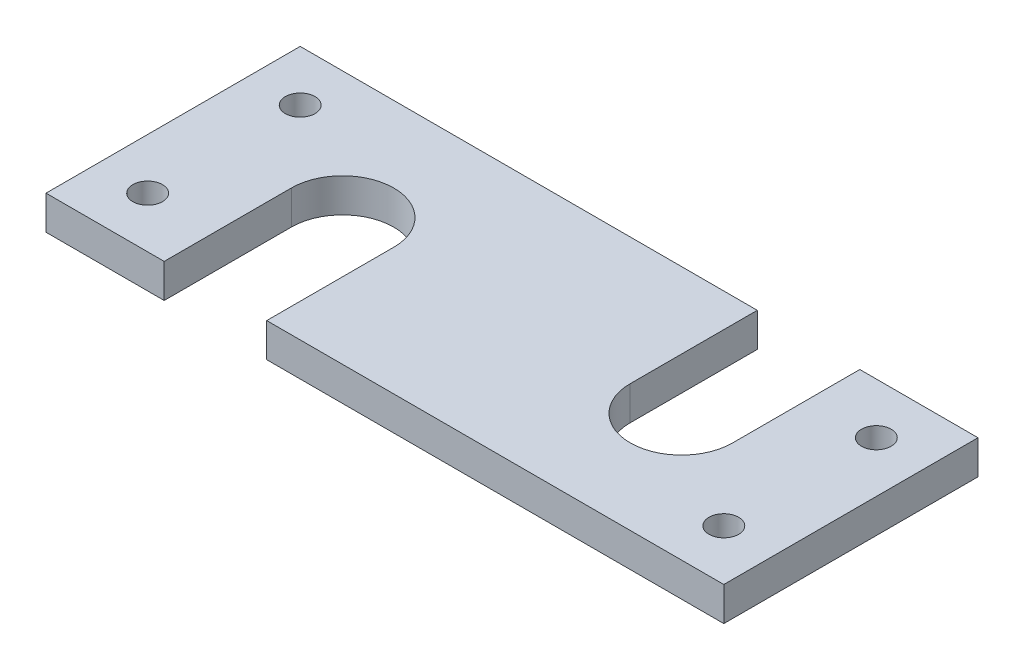
ISO-10303-21;
HEADER;
FILE_DESCRIPTION(('STEP AP214'),'2;1');
FILE_NAME('part.step','',(''),(''),'','','');
FILE_SCHEMA(('AUTOMOTIVE_DESIGN { 1 0 10303 214 1 1 1 1 }'));
ENDSEC;
DATA;
#1=APPLICATION_CONTEXT('core data for automotive mechanical design processes');
#2=APPLICATION_PROTOCOL_DEFINITION('international standard','automotive_design',2000,#1);
#3=PRODUCT_CONTEXT('',#1,'mechanical');
#4=PRODUCT('Part','Part','',(#3));
#5=PRODUCT_RELATED_PRODUCT_CATEGORY('part','',(#4));
#6=PRODUCT_DEFINITION_FORMATION('','',#4);
#7=PRODUCT_DEFINITION_CONTEXT('part definition',#1,'design');
#8=PRODUCT_DEFINITION('design','',#6,#7);
#9=PRODUCT_DEFINITION_SHAPE('','',#8);
#10=(LENGTH_UNIT() NAMED_UNIT(*) SI_UNIT(.MILLI.,.METRE.));
#11=(NAMED_UNIT(*) PLANE_ANGLE_UNIT() SI_UNIT($,.RADIAN.));
#12=(NAMED_UNIT(*) SI_UNIT($,.STERADIAN.) SOLID_ANGLE_UNIT());
#13=UNCERTAINTY_MEASURE_WITH_UNIT(LENGTH_MEASURE(1.E-05),#10,'distance_accuracy_value','');
#14=(GEOMETRIC_REPRESENTATION_CONTEXT(3) GLOBAL_UNCERTAINTY_ASSIGNED_CONTEXT((#13)) GLOBAL_UNIT_ASSIGNED_CONTEXT((#10,
#11,#12)) REPRESENTATION_CONTEXT('',''));
#15=CARTESIAN_POINT('',(0.,0.,0.));
#16=DIRECTION('',(0.,0.,1.));
#17=DIRECTION('',(1.,0.,0.));
#18=AXIS2_PLACEMENT_3D('',#15,#16,#17);
#19=CARTESIAN_POINT('',(0.,4.,-30.));
#20=DIRECTION('',(0.,0.,1.));
#21=DIRECTION('',(1.,0.,0.));
#22=AXIS2_PLACEMENT_3D('',#19,#20,#21);
#23=PLANE('',#22);
#24=DIRECTION('',(-1.,0.,0.));
#25=VECTOR('',#24,1.);
#26=CARTESIAN_POINT('',(0.,0.,-30.));
#27=LINE('',#26,#25);
#28=CARTESIAN_POINT('',(80.,0.,-30.));
#29=VERTEX_POINT('',#28);
#30=CARTESIAN_POINT('',(66.05,0.,-30.));
#31=VERTEX_POINT('',#30);
#32=EDGE_CURVE('E145',#29,#31,#27,.T.);
#33=ORIENTED_EDGE('',*,*,#32,.T.);
#34=DIRECTION('',(0.,1.,0.));
#35=VECTOR('',#34,1.);
#36=CARTESIAN_POINT('',(66.05,0.,-30.));
#37=LINE('',#36,#35);
#38=CARTESIAN_POINT('',(66.05,4.,-30.));
#39=VERTEX_POINT('',#38);
#40=EDGE_CURVE('E185',#31,#39,#37,.T.);
#41=ORIENTED_EDGE('',*,*,#40,.T.);
#42=DIRECTION('',(-1.,0.,0.));
#43=VECTOR('',#42,1.);
#44=CARTESIAN_POINT('',(0.,4.,-30.));
#45=LINE('',#44,#43);
#46=CARTESIAN_POINT('',(80.,4.,-30.));
#47=VERTEX_POINT('',#46);
#48=EDGE_CURVE('E167',#47,#39,#45,.T.);
#49=ORIENTED_EDGE('',*,*,#48,.F.);
#50=DIRECTION('',(0.,-1.,0.));
#51=VECTOR('',#50,1.);
#52=CARTESIAN_POINT('',(80.,4.,-30.));
#53=LINE('',#52,#51);
#54=EDGE_CURVE('E41',#47,#29,#53,.T.);
#55=ORIENTED_EDGE('',*,*,#54,.T.);
#56=EDGE_LOOP('',(#33,#41,#49,#55));
#57=FACE_BOUND('',#56,.T.);
#58=ADVANCED_FACE('F33',(#57),#23,.F.);
#59=CARTESIAN_POINT('',(0.,4.,0.));
#60=DIRECTION('',(0.,0.,-1.));
#61=DIRECTION('',(-1.,0.,0.));
#62=AXIS2_PLACEMENT_3D('',#59,#60,#61);
#63=PLANE('',#62);
#64=DIRECTION('',(1.,0.,0.));
#65=VECTOR('',#64,1.);
#66=CARTESIAN_POINT('',(0.,0.,0.));
#67=LINE('',#66,#65);
#68=CARTESIAN_POINT('',(0.,0.,0.));
#69=VERTEX_POINT('',#68);
#70=CARTESIAN_POINT('',(13.95,0.,0.));
#71=VERTEX_POINT('',#70);
#72=EDGE_CURVE('E149',#69,#71,#67,.T.);
#73=ORIENTED_EDGE('',*,*,#72,.T.);
#74=DIRECTION('',(0.,1.,0.));
#75=VECTOR('',#74,1.);
#76=CARTESIAN_POINT('',(13.95,0.,0.));
#77=LINE('',#76,#75);
#78=CARTESIAN_POINT('',(13.95,4.,0.));
#79=VERTEX_POINT('',#78);
#80=EDGE_CURVE('E199',#71,#79,#77,.T.);
#81=ORIENTED_EDGE('',*,*,#80,.T.);
#82=DIRECTION('',(1.,0.,0.));
#83=VECTOR('',#82,1.);
#84=CARTESIAN_POINT('',(0.,4.,0.));
#85=LINE('',#84,#83);
#86=CARTESIAN_POINT('',(0.,4.,0.));
#87=VERTEX_POINT('',#86);
#88=EDGE_CURVE('E215',#87,#79,#85,.T.);
#89=ORIENTED_EDGE('',*,*,#88,.F.);
#90=DIRECTION('',(0.,-1.,0.));
#91=VECTOR('',#90,1.);
#92=CARTESIAN_POINT('',(0.,4.,0.));
#93=LINE('',#92,#91);
#94=EDGE_CURVE('E155',#87,#69,#93,.T.);
#95=ORIENTED_EDGE('',*,*,#94,.T.);
#96=EDGE_LOOP('',(#73,#81,#89,#95));
#97=FACE_BOUND('',#96,.T.);
#98=ADVANCED_FACE('F240',(#97),#63,.F.);
#99=CARTESIAN_POINT('',(26.05,4.,0.));
#100=VERTEX_POINT('',#99);
#101=CARTESIAN_POINT('',(80.,4.,0.));
#102=VERTEX_POINT('',#101);
#103=EDGE_CURVE('E154',#100,#102,#85,.T.);
#104=ORIENTED_EDGE('',*,*,#103,.F.);
#105=DIRECTION('',(0.,1.,0.));
#106=VECTOR('',#105,1.);
#107=CARTESIAN_POINT('',(26.05,0.,0.));
#108=LINE('',#107,#106);
#109=CARTESIAN_POINT('',(26.05,0.,0.));
#110=VERTEX_POINT('',#109);
#111=EDGE_CURVE('E211',#110,#100,#108,.T.);
#112=ORIENTED_EDGE('',*,*,#111,.F.);
#113=CARTESIAN_POINT('',(80.,0.,0.));
#114=VERTEX_POINT('',#113);
#115=EDGE_CURVE('E208',#110,#114,#67,.T.);
#116=ORIENTED_EDGE('',*,*,#115,.T.);
#117=DIRECTION('',(0.,-1.,0.));
#118=VECTOR('',#117,1.);
#119=CARTESIAN_POINT('',(80.,4.,0.));
#120=LINE('',#119,#118);
#121=EDGE_CURVE('E11',#102,#114,#120,.T.);
#122=ORIENTED_EDGE('',*,*,#121,.F.);
#123=EDGE_LOOP('',(#104,#112,#116,#122));
#124=FACE_BOUND('',#123,.T.);
#125=ADVANCED_FACE('F35',(#124),#63,.F.);
#126=CARTESIAN_POINT('',(80.,4.,0.));
#127=DIRECTION('',(-1.,0.,0.));
#128=DIRECTION('',(0.,0.,1.));
#129=AXIS2_PLACEMENT_3D('',#126,#127,#128);
#130=PLANE('',#129);
#131=DIRECTION('',(0.,0.,-1.));
#132=VECTOR('',#131,1.);
#133=CARTESIAN_POINT('',(80.,0.,0.));
#134=LINE('',#133,#132);
#135=EDGE_CURVE('E146',#114,#29,#134,.T.);
#136=ORIENTED_EDGE('',*,*,#135,.T.);
#137=ORIENTED_EDGE('',*,*,#54,.F.);
#138=DIRECTION('',(0.,0.,-1.));
#139=VECTOR('',#138,1.);
#140=CARTESIAN_POINT('',(80.,4.,0.));
#141=LINE('',#140,#139);
#142=EDGE_CURVE('E218',#102,#47,#141,.T.);
#143=ORIENTED_EDGE('',*,*,#142,.F.);
#144=ORIENTED_EDGE('',*,*,#121,.T.);
#145=EDGE_LOOP('',(#136,#137,#143,#144));
#146=FACE_BOUND('',#145,.T.);
#147=ADVANCED_FACE('F248',(#146),#130,.F.);
#148=CARTESIAN_POINT('',(53.95,4.,-30.));
#149=VERTEX_POINT('',#148);
#150=CARTESIAN_POINT('',(0.,4.,-30.));
#151=VERTEX_POINT('',#150);
#152=EDGE_CURVE('E138',#149,#151,#45,.T.);
#153=ORIENTED_EDGE('',*,*,#152,.F.);
#154=DIRECTION('',(0.,1.,0.));
#155=VECTOR('',#154,1.);
#156=CARTESIAN_POINT('',(53.95,0.,-30.));
#157=LINE('',#156,#155);
#158=CARTESIAN_POINT('',(53.95,0.,-30.));
#159=VERTEX_POINT('',#158);
#160=EDGE_CURVE('E125',#159,#149,#157,.T.);
#161=ORIENTED_EDGE('',*,*,#160,.F.);
#162=CARTESIAN_POINT('',(0.,0.,-30.));
#163=VERTEX_POINT('',#162);
#164=EDGE_CURVE('E136',#159,#163,#27,.T.);
#165=ORIENTED_EDGE('',*,*,#164,.T.);
#166=DIRECTION('',(0.,-1.,0.));
#167=VECTOR('',#166,1.);
#168=CARTESIAN_POINT('',(0.,4.,-30.));
#169=LINE('',#168,#167);
#170=EDGE_CURVE('E158',#151,#163,#169,.T.);
#171=ORIENTED_EDGE('',*,*,#170,.F.);
#172=EDGE_LOOP('',(#153,#161,#165,#171));
#173=FACE_BOUND('',#172,.T.);
#174=ADVANCED_FACE('F134',(#173),#23,.F.);
#175=CARTESIAN_POINT('',(0.,4.,0.));
#176=DIRECTION('',(1.,0.,0.));
#177=DIRECTION('',(0.,0.,-1.));
#178=AXIS2_PLACEMENT_3D('',#175,#176,#177);
#179=PLANE('',#178);
#180=DIRECTION('',(0.,0.,1.));
#181=VECTOR('',#180,1.);
#182=CARTESIAN_POINT('',(0.,0.,0.));
#183=LINE('',#182,#181);
#184=EDGE_CURVE('E144',#163,#69,#183,.T.);
#185=ORIENTED_EDGE('',*,*,#184,.T.);
#186=ORIENTED_EDGE('',*,*,#94,.F.);
#187=DIRECTION('',(0.,0.,1.));
#188=VECTOR('',#187,1.);
#189=CARTESIAN_POINT('',(0.,4.,0.));
#190=LINE('',#189,#188);
#191=EDGE_CURVE('E159',#151,#87,#190,.T.);
#192=ORIENTED_EDGE('',*,*,#191,.F.);
#193=ORIENTED_EDGE('',*,*,#170,.T.);
#194=EDGE_LOOP('',(#185,#186,#192,#193));
#195=FACE_BOUND('',#194,.T.);
#196=ADVANCED_FACE('F244',(#195),#179,.F.);
#197=CARTESIAN_POINT('',(0.,4.,0.));
#198=DIRECTION('',(0.,1.,0.));
#199=DIRECTION('',(0.,0.,1.));
#200=AXIS2_PLACEMENT_3D('',#197,#198,#199);
#201=PLANE('',#200);
#202=CARTESIAN_POINT('',(74.,4.,-6.));
#203=DIRECTION('',(0.,1.,0.));
#204=DIRECTION('',(0.,0.,1.));
#205=AXIS2_PLACEMENT_3D('',#202,#203,#204);
#206=CIRCLE('',#205,1.75);
#207=CARTESIAN_POINT('',(74.,4.,-4.25));
#208=VERTEX_POINT('',#207);
#209=EDGE_CURVE('E303',#208,#208,#206,.T.);
#210=ORIENTED_EDGE('',*,*,#209,.F.);
#211=EDGE_LOOP('',(#210));
#212=FACE_BOUND('',#211,.T.);
#213=CARTESIAN_POINT('',(74.,4.,-24.));
#214=DIRECTION('',(0.,1.,0.));
#215=DIRECTION('',(0.,0.,1.));
#216=AXIS2_PLACEMENT_3D('',#213,#214,#215);
#217=CIRCLE('',#216,1.75);
#218=CARTESIAN_POINT('',(74.,4.,-22.25));
#219=VERTEX_POINT('',#218);
#220=EDGE_CURVE('E305',#219,#219,#217,.T.);
#221=ORIENTED_EDGE('',*,*,#220,.F.);
#222=EDGE_LOOP('',(#221));
#223=FACE_BOUND('',#222,.T.);
#224=CARTESIAN_POINT('',(6.00000000000001,4.,-24.));
#225=DIRECTION('',(0.,1.,0.));
#226=DIRECTION('',(0.,0.,1.));
#227=AXIS2_PLACEMENT_3D('',#224,#225,#226);
#228=CIRCLE('',#227,1.75);
#229=CARTESIAN_POINT('',(6.00000000000001,4.,-22.25));
#230=VERTEX_POINT('',#229);
#231=EDGE_CURVE('E311',#230,#230,#228,.T.);
#232=ORIENTED_EDGE('',*,*,#231,.F.);
#233=EDGE_LOOP('',(#232));
#234=FACE_BOUND('',#233,.T.);
#235=CARTESIAN_POINT('',(6.,4.,-6.));
#236=DIRECTION('',(0.,1.,0.));
#237=DIRECTION('',(0.,0.,1.));
#238=AXIS2_PLACEMENT_3D('',#235,#236,#237);
#239=CIRCLE('',#238,1.75);
#240=CARTESIAN_POINT('',(6.,4.,-4.25));
#241=VERTEX_POINT('',#240);
#242=EDGE_CURVE('E317',#241,#241,#239,.T.);
#243=ORIENTED_EDGE('',*,*,#242,.F.);
#244=EDGE_LOOP('',(#243));
#245=FACE_BOUND('',#244,.T.);
#246=DIRECTION('',(0.,0.,-1.));
#247=VECTOR('',#246,1.);
#248=CARTESIAN_POINT('',(66.05,4.,-15.));
#249=LINE('',#248,#247);
#250=CARTESIAN_POINT('',(66.05,4.,-15.));
#251=VERTEX_POINT('',#250);
#252=EDGE_CURVE('E130',#251,#39,#249,.T.);
#253=ORIENTED_EDGE('',*,*,#252,.F.);
#254=CARTESIAN_POINT('',(60.,4.,-15.));
#255=DIRECTION('',(0.,1.,0.));
#256=DIRECTION('',(0.,0.,1.));
#257=AXIS2_PLACEMENT_3D('',#254,#255,#256);
#258=CIRCLE('',#257,6.05000000000001);
#259=CARTESIAN_POINT('',(53.95,4.,-15.));
#260=VERTEX_POINT('',#259);
#261=EDGE_CURVE('E180',#260,#251,#258,.T.);
#262=ORIENTED_EDGE('',*,*,#261,.F.);
#263=DIRECTION('',(0.,0.,1.));
#264=VECTOR('',#263,1.);
#265=CARTESIAN_POINT('',(53.95,4.,-30.));
#266=LINE('',#265,#264);
#267=EDGE_CURVE('E178',#149,#260,#266,.T.);
#268=ORIENTED_EDGE('',*,*,#267,.F.);
#269=ORIENTED_EDGE('',*,*,#152,.T.);
#270=ORIENTED_EDGE('',*,*,#191,.T.);
#271=ORIENTED_EDGE('',*,*,#88,.T.);
#272=DIRECTION('',(0.,0.,1.));
#273=VECTOR('',#272,1.);
#274=CARTESIAN_POINT('',(13.95,4.,-15.));
#275=LINE('',#274,#273);
#276=CARTESIAN_POINT('',(13.95,4.,-15.));
#277=VERTEX_POINT('',#276);
#278=EDGE_CURVE('E187',#277,#79,#275,.T.);
#279=ORIENTED_EDGE('',*,*,#278,.F.);
#280=CARTESIAN_POINT('',(20.,4.,-15.));
#281=DIRECTION('',(0.,1.,0.));
#282=DIRECTION('',(0.,0.,-1.));
#283=AXIS2_PLACEMENT_3D('',#280,#281,#282);
#284=CIRCLE('',#283,6.05);
#285=CARTESIAN_POINT('',(26.05,4.,-15.));
#286=VERTEX_POINT('',#285);
#287=EDGE_CURVE('E195',#286,#277,#284,.T.);
#288=ORIENTED_EDGE('',*,*,#287,.F.);
#289=DIRECTION('',(0.,0.,-1.));
#290=VECTOR('',#289,1.);
#291=CARTESIAN_POINT('',(26.05,4.,0.));
#292=LINE('',#291,#290);
#293=EDGE_CURVE('E201',#100,#286,#292,.T.);
#294=ORIENTED_EDGE('',*,*,#293,.F.);
#295=ORIENTED_EDGE('',*,*,#103,.T.);
#296=ORIENTED_EDGE('',*,*,#142,.T.);
#297=ORIENTED_EDGE('',*,*,#48,.T.);
#298=EDGE_LOOP('',(#253,#262,#268,#269,#270,#271,#279,#288,#294,#295,#296,#297));
#299=FACE_BOUND('',#298,.T.);
#300=ADVANCED_FACE('F236',(#212,#223,#234,#245,#299),#201,.T.);
#301=CARTESIAN_POINT('',(0.,0.,0.));
#302=DIRECTION('',(0.,1.,0.));
#303=DIRECTION('',(0.,0.,1.));
#304=AXIS2_PLACEMENT_3D('',#301,#302,#303);
#305=PLANE('',#304);
#306=CARTESIAN_POINT('',(74.,0.,-6.));
#307=DIRECTION('',(0.,1.,0.));
#308=DIRECTION('',(0.,0.,1.));
#309=AXIS2_PLACEMENT_3D('',#306,#307,#308);
#310=CIRCLE('',#309,1.75);
#311=CARTESIAN_POINT('',(74.,0.,-4.25));
#312=VERTEX_POINT('',#311);
#313=EDGE_CURVE('E300',#312,#312,#310,.T.);
#314=ORIENTED_EDGE('',*,*,#313,.T.);
#315=EDGE_LOOP('',(#314));
#316=FACE_BOUND('',#315,.T.);
#317=CARTESIAN_POINT('',(74.,0.,-24.));
#318=DIRECTION('',(0.,1.,0.));
#319=DIRECTION('',(0.,0.,1.));
#320=AXIS2_PLACEMENT_3D('',#317,#318,#319);
#321=CIRCLE('',#320,1.75);
#322=CARTESIAN_POINT('',(74.,0.,-22.25));
#323=VERTEX_POINT('',#322);
#324=EDGE_CURVE('E308',#323,#323,#321,.T.);
#325=ORIENTED_EDGE('',*,*,#324,.T.);
#326=EDGE_LOOP('',(#325));
#327=FACE_BOUND('',#326,.T.);
#328=CARTESIAN_POINT('',(6.00000000000001,0.,-24.));
#329=DIRECTION('',(0.,1.,0.));
#330=DIRECTION('',(0.,0.,1.));
#331=AXIS2_PLACEMENT_3D('',#328,#329,#330);
#332=CIRCLE('',#331,1.75);
#333=CARTESIAN_POINT('',(6.00000000000001,0.,-22.25));
#334=VERTEX_POINT('',#333);
#335=EDGE_CURVE('E314',#334,#334,#332,.T.);
#336=ORIENTED_EDGE('',*,*,#335,.T.);
#337=EDGE_LOOP('',(#336));
#338=FACE_BOUND('',#337,.T.);
#339=CARTESIAN_POINT('',(6.,0.,-6.));
#340=DIRECTION('',(0.,1.,0.));
#341=DIRECTION('',(0.,0.,1.));
#342=AXIS2_PLACEMENT_3D('',#339,#340,#341);
#343=CIRCLE('',#342,1.75);
#344=CARTESIAN_POINT('',(6.,0.,-4.25));
#345=VERTEX_POINT('',#344);
#346=EDGE_CURVE('E181',#345,#345,#343,.T.);
#347=ORIENTED_EDGE('',*,*,#346,.T.);
#348=EDGE_LOOP('',(#347));
#349=FACE_BOUND('',#348,.T.);
#350=CARTESIAN_POINT('',(60.,0.,-15.));
#351=DIRECTION('',(0.,1.,0.));
#352=DIRECTION('',(0.,0.,1.));
#353=AXIS2_PLACEMENT_3D('',#350,#351,#352);
#354=CIRCLE('',#353,6.05000000000001);
#355=CARTESIAN_POINT('',(53.95,0.,-15.));
#356=VERTEX_POINT('',#355);
#357=CARTESIAN_POINT('',(66.05,0.,-15.));
#358=VERTEX_POINT('',#357);
#359=EDGE_CURVE('E48',#356,#358,#354,.T.);
#360=ORIENTED_EDGE('',*,*,#359,.T.);
#361=DIRECTION('',(0.,0.,-1.));
#362=VECTOR('',#361,1.);
#363=CARTESIAN_POINT('',(66.05,0.,-15.));
#364=LINE('',#363,#362);
#365=EDGE_CURVE('E139',#358,#31,#364,.T.);
#366=ORIENTED_EDGE('',*,*,#365,.T.);
#367=ORIENTED_EDGE('',*,*,#32,.F.);
#368=ORIENTED_EDGE('',*,*,#135,.F.);
#369=ORIENTED_EDGE('',*,*,#115,.F.);
#370=DIRECTION('',(0.,0.,-1.));
#371=VECTOR('',#370,1.);
#372=CARTESIAN_POINT('',(26.05,0.,0.));
#373=LINE('',#372,#371);
#374=CARTESIAN_POINT('',(26.05,0.,-15.));
#375=VERTEX_POINT('',#374);
#376=EDGE_CURVE('E194',#110,#375,#373,.T.);
#377=ORIENTED_EDGE('',*,*,#376,.T.);
#378=CARTESIAN_POINT('',(20.,0.,-15.));
#379=DIRECTION('',(0.,1.,0.));
#380=DIRECTION('',(0.,0.,-1.));
#381=AXIS2_PLACEMENT_3D('',#378,#379,#380);
#382=CIRCLE('',#381,6.05);
#383=CARTESIAN_POINT('',(13.95,0.,-15.));
#384=VERTEX_POINT('',#383);
#385=EDGE_CURVE('E56',#375,#384,#382,.T.);
#386=ORIENTED_EDGE('',*,*,#385,.T.);
#387=DIRECTION('',(0.,0.,1.));
#388=VECTOR('',#387,1.);
#389=CARTESIAN_POINT('',(13.95,0.,-15.));
#390=LINE('',#389,#388);
#391=EDGE_CURVE('E191',#384,#71,#390,.T.);
#392=ORIENTED_EDGE('',*,*,#391,.T.);
#393=ORIENTED_EDGE('',*,*,#72,.F.);
#394=ORIENTED_EDGE('',*,*,#184,.F.);
#395=ORIENTED_EDGE('',*,*,#164,.F.);
#396=DIRECTION('',(0.,0.,1.));
#397=VECTOR('',#396,1.);
#398=CARTESIAN_POINT('',(53.95,0.,-30.));
#399=LINE('',#398,#397);
#400=EDGE_CURVE('E121',#159,#356,#399,.T.);
#401=ORIENTED_EDGE('',*,*,#400,.T.);
#402=EDGE_LOOP('',(#360,#366,#367,#368,#369,#377,#386,#392,#393,#394,#395,#401));
#403=FACE_BOUND('',#402,.T.);
#404=ADVANCED_FACE('F142',(#316,#327,#338,#349,#403),#305,.F.);
#405=CARTESIAN_POINT('',(13.95,0.,-15.));
#406=DIRECTION('',(-1.,0.,0.));
#407=DIRECTION('',(0.,0.,1.));
#408=AXIS2_PLACEMENT_3D('',#405,#406,#407);
#409=PLANE('',#408);
#410=ORIENTED_EDGE('',*,*,#278,.T.);
#411=ORIENTED_EDGE('',*,*,#80,.F.);
#412=ORIENTED_EDGE('',*,*,#391,.F.);
#413=DIRECTION('',(0.,1.,0.));
#414=VECTOR('',#413,1.);
#415=CARTESIAN_POINT('',(13.95,0.,-15.));
#416=LINE('',#415,#414);
#417=EDGE_CURVE('E206',#384,#277,#416,.T.);
#418=ORIENTED_EDGE('',*,*,#417,.T.);
#419=EDGE_LOOP('',(#410,#411,#412,#418));
#420=FACE_BOUND('',#419,.T.);
#421=ADVANCED_FACE('F239',(#420),#409,.F.);
#422=CARTESIAN_POINT('',(20.,0.,-15.));
#423=DIRECTION('',(0.,1.,0.));
#424=DIRECTION('',(0.,0.,1.));
#425=AXIS2_PLACEMENT_3D('',#422,#423,#424);
#426=CYLINDRICAL_SURFACE('',#425,6.05);
#427=ORIENTED_EDGE('',*,*,#287,.T.);
#428=ORIENTED_EDGE('',*,*,#417,.F.);
#429=ORIENTED_EDGE('',*,*,#385,.F.);
#430=DIRECTION('',(0.,1.,0.));
#431=VECTOR('',#430,1.);
#432=CARTESIAN_POINT('',(26.05,0.,-15.));
#433=LINE('',#432,#431);
#434=EDGE_CURVE('E209',#375,#286,#433,.T.);
#435=ORIENTED_EDGE('',*,*,#434,.T.);
#436=EDGE_LOOP('',(#427,#428,#429,#435));
#437=FACE_BOUND('',#436,.T.);
#438=ADVANCED_FACE('F231',(#437),#426,.F.);
#439=CARTESIAN_POINT('',(26.05,0.,0.));
#440=DIRECTION('',(1.,0.,0.));
#441=DIRECTION('',(0.,0.,-1.));
#442=AXIS2_PLACEMENT_3D('',#439,#440,#441);
#443=PLANE('',#442);
#444=ORIENTED_EDGE('',*,*,#293,.T.);
#445=ORIENTED_EDGE('',*,*,#434,.F.);
#446=ORIENTED_EDGE('',*,*,#376,.F.);
#447=ORIENTED_EDGE('',*,*,#111,.T.);
#448=EDGE_LOOP('',(#444,#445,#446,#447));
#449=FACE_BOUND('',#448,.T.);
#450=ADVANCED_FACE('F228',(#449),#443,.F.);
#451=CARTESIAN_POINT('',(66.05,0.,-15.));
#452=DIRECTION('',(1.,0.,0.));
#453=DIRECTION('',(0.,0.,-1.));
#454=AXIS2_PLACEMENT_3D('',#451,#452,#453);
#455=PLANE('',#454);
#456=ORIENTED_EDGE('',*,*,#252,.T.);
#457=ORIENTED_EDGE('',*,*,#40,.F.);
#458=ORIENTED_EDGE('',*,*,#365,.F.);
#459=DIRECTION('',(0.,1.,0.));
#460=VECTOR('',#459,1.);
#461=CARTESIAN_POINT('',(66.05,0.,-15.));
#462=LINE('',#461,#460);
#463=EDGE_CURVE('E188',#358,#251,#462,.T.);
#464=ORIENTED_EDGE('',*,*,#463,.T.);
#465=EDGE_LOOP('',(#456,#457,#458,#464));
#466=FACE_BOUND('',#465,.T.);
#467=ADVANCED_FACE('F247',(#466),#455,.F.);
#468=CARTESIAN_POINT('',(60.,0.,-15.));
#469=DIRECTION('',(0.,1.,0.));
#470=DIRECTION('',(0.,0.,1.));
#471=AXIS2_PLACEMENT_3D('',#468,#469,#470);
#472=CYLINDRICAL_SURFACE('',#471,6.05000000000001);
#473=ORIENTED_EDGE('',*,*,#261,.T.);
#474=ORIENTED_EDGE('',*,*,#463,.F.);
#475=ORIENTED_EDGE('',*,*,#359,.F.);
#476=DIRECTION('',(0.,1.,0.));
#477=VECTOR('',#476,1.);
#478=CARTESIAN_POINT('',(53.95,0.,-15.));
#479=LINE('',#478,#477);
#480=EDGE_CURVE('E127',#356,#260,#479,.T.);
#481=ORIENTED_EDGE('',*,*,#480,.T.);
#482=EDGE_LOOP('',(#473,#474,#475,#481));
#483=FACE_BOUND('',#482,.T.);
#484=ADVANCED_FACE('F246',(#483),#472,.F.);
#485=CARTESIAN_POINT('',(53.95,0.,-30.));
#486=DIRECTION('',(-1.,0.,0.));
#487=DIRECTION('',(0.,0.,1.));
#488=AXIS2_PLACEMENT_3D('',#485,#486,#487);
#489=PLANE('',#488);
#490=ORIENTED_EDGE('',*,*,#267,.T.);
#491=ORIENTED_EDGE('',*,*,#480,.F.);
#492=ORIENTED_EDGE('',*,*,#400,.F.);
#493=ORIENTED_EDGE('',*,*,#160,.T.);
#494=EDGE_LOOP('',(#490,#491,#492,#493));
#495=FACE_BOUND('',#494,.T.);
#496=ADVANCED_FACE('F124',(#495),#489,.F.);
#497=CARTESIAN_POINT('',(6.,0.,-6.));
#498=DIRECTION('',(0.,1.,0.));
#499=DIRECTION('',(0.,0.,1.));
#500=AXIS2_PLACEMENT_3D('',#497,#498,#499);
#501=CYLINDRICAL_SURFACE('',#500,1.75);
#502=ORIENTED_EDGE('',*,*,#346,.F.);
#503=EDGE_LOOP('',(#502));
#504=FACE_BOUND('',#503,.T.);
#505=ORIENTED_EDGE('',*,*,#242,.T.);
#506=EDGE_LOOP('',(#505));
#507=FACE_BOUND('',#506,.T.);
#508=ADVANCED_FACE('F276',(#504,#507),#501,.F.);
#509=CARTESIAN_POINT('',(6.00000000000001,0.,-24.));
#510=DIRECTION('',(0.,1.,0.));
#511=DIRECTION('',(0.,0.,1.));
#512=AXIS2_PLACEMENT_3D('',#509,#510,#511);
#513=CYLINDRICAL_SURFACE('',#512,1.75);
#514=ORIENTED_EDGE('',*,*,#335,.F.);
#515=EDGE_LOOP('',(#514));
#516=FACE_BOUND('',#515,.T.);
#517=ORIENTED_EDGE('',*,*,#231,.T.);
#518=EDGE_LOOP('',(#517));
#519=FACE_BOUND('',#518,.T.);
#520=ADVANCED_FACE('F283',(#516,#519),#513,.F.);
#521=CARTESIAN_POINT('',(74.,0.,-24.));
#522=DIRECTION('',(0.,1.,0.));
#523=DIRECTION('',(0.,0.,1.));
#524=AXIS2_PLACEMENT_3D('',#521,#522,#523);
#525=CYLINDRICAL_SURFACE('',#524,1.75);
#526=ORIENTED_EDGE('',*,*,#324,.F.);
#527=EDGE_LOOP('',(#526));
#528=FACE_BOUND('',#527,.T.);
#529=ORIENTED_EDGE('',*,*,#220,.T.);
#530=EDGE_LOOP('',(#529));
#531=FACE_BOUND('',#530,.T.);
#532=ADVANCED_FACE('F287',(#528,#531),#525,.F.);
#533=CARTESIAN_POINT('',(74.,0.,-6.));
#534=DIRECTION('',(0.,1.,0.));
#535=DIRECTION('',(0.,0.,1.));
#536=AXIS2_PLACEMENT_3D('',#533,#534,#535);
#537=CYLINDRICAL_SURFACE('',#536,1.75);
#538=ORIENTED_EDGE('',*,*,#313,.F.);
#539=EDGE_LOOP('',(#538));
#540=FACE_BOUND('',#539,.T.);
#541=ORIENTED_EDGE('',*,*,#209,.T.);
#542=EDGE_LOOP('',(#541));
#543=FACE_BOUND('',#542,.T.);
#544=ADVANCED_FACE('F291',(#540,#543),#537,.F.);
#545=CLOSED_SHELL('',(#58,#98,#125,#147,#174,#196,#300,#404,#421,#438,#450,#467,#484,#496,#508,
#520,#532,#544));
#546=MANIFOLD_SOLID_BREP('B2',#545);
#547=ADVANCED_BREP_SHAPE_REPRESENTATION('',(#18,#546),#14);
#548=SHAPE_DEFINITION_REPRESENTATION(#9,#547);
ENDSEC;
END-ISO-10303-21;
